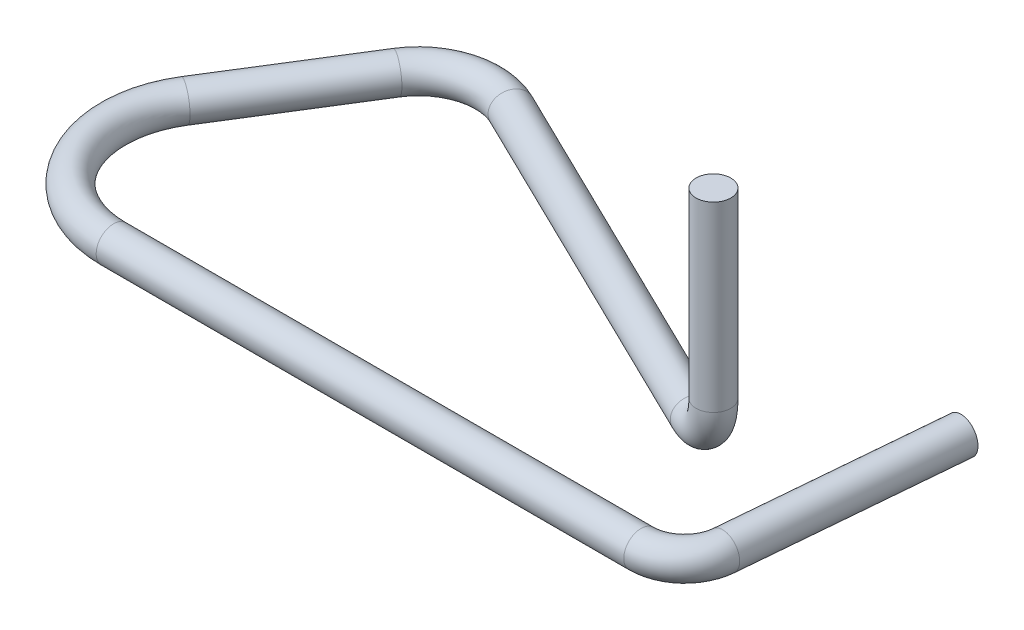
ISO-10303-21;
HEADER;
FILE_DESCRIPTION(('STEP AP214'),'2;1');
FILE_NAME('part.step','',(''),(''),'','','');
FILE_SCHEMA(('AUTOMOTIVE_DESIGN { 1 0 10303 214 1 1 1 1 }'));
ENDSEC;
DATA;
#1=APPLICATION_CONTEXT('core data for automotive mechanical design processes');
#2=APPLICATION_PROTOCOL_DEFINITION('international standard','automotive_design',2000,#1);
#3=PRODUCT_CONTEXT('',#1,'mechanical');
#4=PRODUCT('Part','Part','',(#3));
#5=PRODUCT_RELATED_PRODUCT_CATEGORY('part','',(#4));
#6=PRODUCT_DEFINITION_FORMATION('','',#4);
#7=PRODUCT_DEFINITION_CONTEXT('part definition',#1,'design');
#8=PRODUCT_DEFINITION('design','',#6,#7);
#9=PRODUCT_DEFINITION_SHAPE('','',#8);
#10=(LENGTH_UNIT() NAMED_UNIT(*) SI_UNIT(.MILLI.,.METRE.));
#11=(NAMED_UNIT(*) PLANE_ANGLE_UNIT() SI_UNIT($,.RADIAN.));
#12=(NAMED_UNIT(*) SI_UNIT($,.STERADIAN.) SOLID_ANGLE_UNIT());
#13=UNCERTAINTY_MEASURE_WITH_UNIT(LENGTH_MEASURE(1.E-05),#10,'distance_accuracy_value','');
#14=(GEOMETRIC_REPRESENTATION_CONTEXT(3) GLOBAL_UNCERTAINTY_ASSIGNED_CONTEXT((#13)) GLOBAL_UNIT_ASSIGNED_CONTEXT((#10,
#11,#12)) REPRESENTATION_CONTEXT('',''));
#15=CARTESIAN_POINT('',(0.,0.,0.));
#16=DIRECTION('',(0.,0.,1.));
#17=DIRECTION('',(1.,0.,0.));
#18=AXIS2_PLACEMENT_3D('',#15,#16,#17);
#19=CARTESIAN_POINT('',(20.2685697237176,0.,-1.66731220671048));
#20=DIRECTION('',(0.0871557427476615,0.,-0.996194698091745));
#21=DIRECTION('',(-0.996194698091745,0.,-0.0871557427476615));
#22=AXIS2_PLACEMENT_3D('',#19,#20,#21);
#23=CYLINDRICAL_SURFACE('',#22,0.508000000000002);
#24=CARTESIAN_POINT('',(20.2685697237176,0.,-1.66731220671048));
#25=DIRECTION('',(-0.0871557427476629,0.,0.996194698091745));
#26=DIRECTION('',(-0.895373863599654,-0.438371146789083,-0.078335062682381));
#27=AXIS2_PLACEMENT_3D('',#24,#25,#26);
#28=CIRCLE('',#27,0.508000000000002);
#29=CARTESIAN_POINT('',(20.7746366303482,0.,-1.62303708939466));
#30=VERTEX_POINT('',#29);
#31=EDGE_CURVE('E34',#30,#30,#28,.T.);
#32=ORIENTED_EDGE('',*,*,#31,.F.);
#33=EDGE_LOOP('',(#32));
#34=FACE_BOUND('',#33,.T.);
#35=CARTESIAN_POINT('',(20.8299330933694,0.,-8.08372488268419));
#36=DIRECTION('',(-0.0871557427476629,0.,0.996194698091745));
#37=DIRECTION('',(-0.895373863599654,-0.438371146789083,-0.078335062682381));
#38=AXIS2_PLACEMENT_3D('',#35,#36,#37);
#39=CIRCLE('',#38,0.508000000000002);
#40=CARTESIAN_POINT('',(20.3750831706608,-0.222692542568853,-8.12351909452684));
#41=VERTEX_POINT('',#40);
#42=EDGE_CURVE('E10',#41,#41,#39,.T.);
#43=ORIENTED_EDGE('',*,*,#42,.T.);
#44=EDGE_LOOP('',(#43));
#45=FACE_BOUND('',#44,.T.);
#46=ADVANCED_FACE('F28',(#34,#45),#23,.T.);
#47=CARTESIAN_POINT('',(19.0034024571411,0.,-1.778));
#48=DIRECTION('',(0.,1.,0.));
#49=DIRECTION('',(0.,0.,1.));
#50=AXIS2_PLACEMENT_3D('',#47,#48,#49);
#51=TOROIDAL_SURFACE('',#50,1.27,0.508000000000002);
#52=CARTESIAN_POINT('',(19.0034024571411,0.,-0.507999999999999));
#53=DIRECTION('',(-1.,0.,0.));
#54=DIRECTION('',(0.,-0.438371146789083,-0.898794046299165));
#55=AXIS2_PLACEMENT_3D('',#52,#53,#54);
#56=CIRCLE('',#55,0.508000000000002);
#57=CARTESIAN_POINT('',(19.0034024571411,0.,0.));
#58=VERTEX_POINT('',#57);
#59=EDGE_CURVE('E38',#58,#58,#56,.T.);
#60=CARTESIAN_POINT('',(19.0034024571411,0.,-1.778));
#61=DIRECTION('',(0.,1.,0.));
#62=DIRECTION('',(0.,0.,1.));
#63=AXIS2_PLACEMENT_3D('',#60,#61,#62);
#64=CIRCLE('',#63,1.77800000000001);
#65=EDGE_CURVE('',#58,#30,#64,.T.);
#66=ORIENTED_EDGE('',*,*,#59,.F.);
#67=ORIENTED_EDGE('',*,*,#31,.T.);
#68=ORIENTED_EDGE('',*,*,#65,.T.);
#69=ORIENTED_EDGE('',*,*,#65,.F.);
#70=EDGE_LOOP('',(#66,#68,#67,#69));
#71=FACE_BOUND('',#70,.T.);
#72=ADVANCED_FACE('F102',(#71),#51,.T.);
#73=CARTESIAN_POINT('',(3.556,0.,-0.507999999999997));
#74=DIRECTION('',(1.,0.,0.));
#75=DIRECTION('',(0.,0.,-1.));
#76=AXIS2_PLACEMENT_3D('',#73,#74,#75);
#77=CYLINDRICAL_SURFACE('',#76,0.508000000000002);
#78=CARTESIAN_POINT('',(3.556,0.,-0.507999999999997));
#79=DIRECTION('',(-1.,0.,0.));
#80=DIRECTION('',(0.,-0.438371146789083,-0.898794046299165));
#81=AXIS2_PLACEMENT_3D('',#78,#79,#80);
#82=CIRCLE('',#81,0.508000000000002);
#83=CARTESIAN_POINT('',(3.556,0.,0.));
#84=VERTEX_POINT('',#83);
#85=EDGE_CURVE('E42',#84,#84,#82,.T.);
#86=ORIENTED_EDGE('',*,*,#85,.F.);
#87=EDGE_LOOP('',(#86));
#88=FACE_BOUND('',#87,.T.);
#89=ORIENTED_EDGE('',*,*,#59,.T.);
#90=EDGE_LOOP('',(#89));
#91=FACE_BOUND('',#90,.T.);
#92=ADVANCED_FACE('F96',(#88,#91),#77,.T.);
#93=CARTESIAN_POINT('',(3.556,0.,-3.556));
#94=DIRECTION('',(0.,1.,0.));
#95=DIRECTION('',(0.,0.,1.));
#96=AXIS2_PLACEMENT_3D('',#93,#94,#95);
#97=TOROIDAL_SURFACE('',#96,3.048,0.508000000000002);
#98=CARTESIAN_POINT('',(0.971149402915211,0.,-5.17119391738281));
#99=DIRECTION('',(0.529919264233207,0.,-0.848048096156425));
#100=DIRECTION('',(0.762220579800736,-0.438371146789083,0.476288279712041));
#101=AXIS2_PLACEMENT_3D('',#98,#99,#100);
#102=CIRCLE('',#101,0.508000000000002);
#103=CARTESIAN_POINT('',(0.540340970067745,0.,-5.44039290361328));
#104=VERTEX_POINT('',#103);
#105=EDGE_CURVE('E47',#104,#104,#102,.T.);
#106=CARTESIAN_POINT('',(3.556,0.,-3.556));
#107=DIRECTION('',(0.,1.,0.));
#108=DIRECTION('',(0.,0.,1.));
#109=AXIS2_PLACEMENT_3D('',#106,#107,#108);
#110=CIRCLE('',#109,3.55600000000001);
#111=EDGE_CURVE('',#104,#84,#110,.T.);
#112=ORIENTED_EDGE('',*,*,#105,.F.);
#113=ORIENTED_EDGE('',*,*,#85,.T.);
#114=ORIENTED_EDGE('',*,*,#111,.T.);
#115=ORIENTED_EDGE('',*,*,#111,.F.);
#116=EDGE_LOOP('',(#112,#114,#113,#115));
#117=FACE_BOUND('',#116,.T.);
#118=ADVANCED_FACE('F90',(#117),#97,.T.);
#119=CARTESIAN_POINT('',(3.35676626861014,0.,-8.98897896061708));
#120=DIRECTION('',(-0.529919264233206,0.,0.848048096156425));
#121=DIRECTION('',(0.848048096156426,0.,0.529919264233206));
#122=AXIS2_PLACEMENT_3D('',#119,#120,#121);
#123=CYLINDRICAL_SURFACE('',#122,0.508000000000002);
#124=CARTESIAN_POINT('',(3.35676626861014,0.,-8.98897896061708));
#125=DIRECTION('',(0.529919264233207,0.,-0.848048096156425));
#126=DIRECTION('',(0.762220579800736,-0.438371146789083,0.476288279712041));
#127=AXIS2_PLACEMENT_3D('',#124,#125,#126);
#128=CIRCLE('',#127,0.508000000000002);
#129=CARTESIAN_POINT('',(2.92595783576267,0.,-9.25817794684755));
#130=VERTEX_POINT('',#129);
#131=EDGE_CURVE('E50',#130,#130,#128,.T.);
#132=ORIENTED_EDGE('',*,*,#131,.F.);
#133=EDGE_LOOP('',(#132));
#134=FACE_BOUND('',#133,.T.);
#135=ORIENTED_EDGE('',*,*,#105,.T.);
#136=EDGE_LOOP('',(#135));
#137=FACE_BOUND('',#136,.T.);
#138=ADVANCED_FACE('F84',(#134,#137),#123,.T.);
#139=CARTESIAN_POINT('',(5.08,0.,-7.91218301569521));
#140=DIRECTION('',(0.,1.,0.));
#141=DIRECTION('',(0.,0.,1.));
#142=AXIS2_PLACEMENT_3D('',#139,#140,#141);
#143=TOROIDAL_SURFACE('',#142,2.03200000000001,0.508000000000002);
#144=CARTESIAN_POINT('',(5.97077017027541,0.,-9.73853251777512));
#145=DIRECTION('',(0.898794046299165,0.,0.438371146789083));
#146=DIRECTION('',(-0.394005376803365,-0.438371146789083,0.807830737662825));
#147=AXIS2_PLACEMENT_3D('',#144,#145,#146);
#148=CIRCLE('',#147,0.508000000000002);
#149=CARTESIAN_POINT('',(6.19346271284427,0.,-10.1951198932951));
#150=VERTEX_POINT('',#149);
#151=EDGE_CURVE('E53',#150,#150,#148,.T.);
#152=CARTESIAN_POINT('',(5.08,0.,-7.91218301569521));
#153=DIRECTION('',(0.,1.,0.));
#154=DIRECTION('',(0.,0.,1.));
#155=AXIS2_PLACEMENT_3D('',#152,#153,#154);
#156=CIRCLE('',#155,2.54000000000001);
#157=EDGE_CURVE('',#150,#130,#156,.T.);
#158=ORIENTED_EDGE('',*,*,#151,.F.);
#159=ORIENTED_EDGE('',*,*,#131,.T.);
#160=ORIENTED_EDGE('',*,*,#157,.T.);
#161=ORIENTED_EDGE('',*,*,#157,.F.);
#162=EDGE_LOOP('',(#158,#160,#159,#161));
#163=FACE_BOUND('',#162,.T.);
#164=ADVANCED_FACE('F78',(#163),#143,.T.);
#165=CARTESIAN_POINT('',(16.3845315612001,0.,-4.65940171787214));
#166=DIRECTION('',(-0.898794046299164,0.,-0.438371146789083));
#167=DIRECTION('',(-0.438371146789083,0.,0.898794046299164));
#168=AXIS2_PLACEMENT_3D('',#165,#166,#167);
#169=CYLINDRICAL_SURFACE('',#168,0.508000000000002);
#170=CARTESIAN_POINT('',(16.3845315612001,0.,-4.65940171787214));
#171=DIRECTION('',(0.898794046299165,0.,0.438371146789083));
#172=DIRECTION('',(-0.394005376803365,-0.438371146789083,0.807830737662825));
#173=AXIS2_PLACEMENT_3D('',#170,#171,#172);
#174=CIRCLE('',#173,0.508000000000002);
#175=CARTESIAN_POINT('',(16.3845315612001,-0.508,-4.65940171787214));
#176=VERTEX_POINT('',#175);
#177=EDGE_CURVE('E56',#176,#176,#174,.T.);
#178=ORIENTED_EDGE('',*,*,#177,.F.);
#179=EDGE_LOOP('',(#178));
#180=FACE_BOUND('',#179,.T.);
#181=ORIENTED_EDGE('',*,*,#151,.T.);
#182=EDGE_LOOP('',(#181));
#183=FACE_BOUND('',#182,.T.);
#184=ADVANCED_FACE('F72',(#180,#183),#169,.T.);
#185=CARTESIAN_POINT('',(16.3845315612001,1.27,-4.65940171787214));
#186=DIRECTION('',(0.438371146789083,0.,-0.898794046299165));
#187=DIRECTION('',(-0.898794046299165,0.,-0.438371146789083));
#188=AXIS2_PLACEMENT_3D('',#185,#186,#187);
#189=TOROIDAL_SURFACE('',#188,1.27,0.508000000000002);
#190=CARTESIAN_POINT('',(17.526,1.27,-4.10267036145001));
#191=DIRECTION('',(0.,1.,0.));
#192=DIRECTION('',(0.,0.,1.));
#193=AXIS2_PLACEMENT_3D('',#190,#191,#192);
#194=CIRCLE('',#193,0.508000000000002);
#195=CARTESIAN_POINT('',(17.98258737552,1.27,-3.87997781888115));
#196=VERTEX_POINT('',#195);
#197=EDGE_CURVE('E59',#196,#196,#194,.T.);
#198=CARTESIAN_POINT('',(16.3845315612001,1.27,-4.65940171787214));
#199=DIRECTION('',(0.438371146789083,0.,-0.898794046299165));
#200=DIRECTION('',(-0.898794046299165,0.,-0.438371146789083));
#201=AXIS2_PLACEMENT_3D('',#198,#199,#200);
#202=CIRCLE('',#201,1.778);
#203=EDGE_CURVE('',#196,#176,#202,.T.);
#204=ORIENTED_EDGE('',*,*,#197,.F.);
#205=ORIENTED_EDGE('',*,*,#177,.T.);
#206=ORIENTED_EDGE('',*,*,#203,.T.);
#207=ORIENTED_EDGE('',*,*,#203,.F.);
#208=EDGE_LOOP('',(#204,#206,#205,#207));
#209=FACE_BOUND('',#208,.T.);
#210=ADVANCED_FACE('F69',(#209),#189,.T.);
#211=CARTESIAN_POINT('',(17.526,1.27,-4.10267036145001));
#212=DIRECTION('',(0.,1.,0.));
#213=DIRECTION('',(0.,0.,1.));
#214=AXIS2_PLACEMENT_3D('',#211,#212,#213);
#215=CYLINDRICAL_SURFACE('',#214,0.508000000000002);
#216=ORIENTED_EDGE('',*,*,#197,.T.);
#217=EDGE_LOOP('',(#216));
#218=FACE_BOUND('',#217,.T.);
#219=CARTESIAN_POINT('',(17.526,6.604,-4.10267036145001));
#220=DIRECTION('',(0.,1.,0.));
#221=DIRECTION('',(0.,0.,1.));
#222=AXIS2_PLACEMENT_3D('',#219,#220,#221);
#223=CIRCLE('',#222,0.508000000000002);
#224=CARTESIAN_POINT('',(17.526,6.604,-3.59467036145));
#225=VERTEX_POINT('',#224);
#226=EDGE_CURVE('E60',#225,#225,#223,.T.);
#227=ORIENTED_EDGE('',*,*,#226,.F.);
#228=EDGE_LOOP('',(#227));
#229=FACE_BOUND('',#228,.T.);
#230=ADVANCED_FACE('F66',(#218,#229),#215,.T.);
#231=CARTESIAN_POINT('',(20.8299330933694,0.,-8.08372488268419));
#232=DIRECTION('',(-0.0871557427476629,0.,0.996194698091745));
#233=DIRECTION('',(-0.895373863599654,-0.438371146789083,-0.078335062682381));
#234=AXIS2_PLACEMENT_3D('',#231,#232,#233);
#235=PLANE('',#234);
#236=ORIENTED_EDGE('',*,*,#42,.F.);
#237=EDGE_LOOP('',(#236));
#238=FACE_BOUND('',#237,.T.);
#239=ADVANCED_FACE('F114',(#238),#235,.F.);
#240=CARTESIAN_POINT('',(17.526,6.604,-4.10267036145001));
#241=DIRECTION('',(0.,1.,0.));
#242=DIRECTION('',(0.,0.,1.));
#243=AXIS2_PLACEMENT_3D('',#240,#241,#242);
#244=PLANE('',#243);
#245=ORIENTED_EDGE('',*,*,#226,.T.);
#246=EDGE_LOOP('',(#245));
#247=FACE_BOUND('',#246,.T.);
#248=ADVANCED_FACE('F115',(#247),#244,.T.);
#249=CLOSED_SHELL('',(#46,#72,#92,#118,#138,#164,#184,#210,#230,#239,#248));
#250=MANIFOLD_SOLID_BREP('B2',#249);
#251=ADVANCED_BREP_SHAPE_REPRESENTATION('',(#18,#250),#14);
#252=SHAPE_DEFINITION_REPRESENTATION(#9,#251);
ENDSEC;
END-ISO-10303-21;
